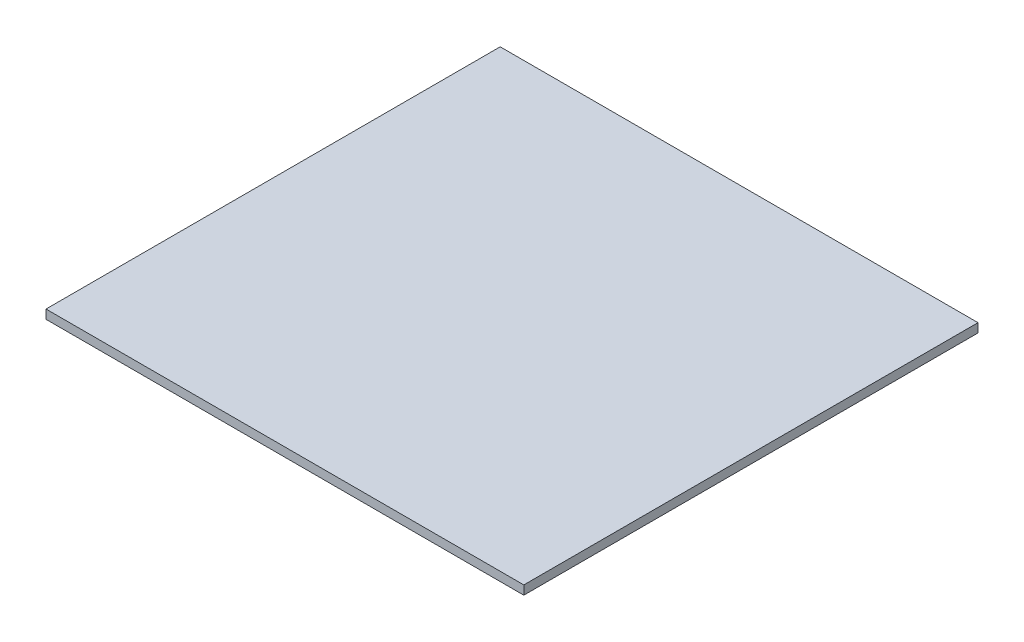
ISO-10303-21;
HEADER;
FILE_DESCRIPTION(('STEP AP214'),'2;1');
FILE_NAME('part.step','',(''),(''),'','','');
FILE_SCHEMA(('AUTOMOTIVE_DESIGN { 1 0 10303 214 1 1 1 1 }'));
ENDSEC;
DATA;
#1=APPLICATION_CONTEXT('core data for automotive mechanical design processes');
#2=APPLICATION_PROTOCOL_DEFINITION('international standard','automotive_design',2000,#1);
#3=PRODUCT_CONTEXT('',#1,'mechanical');
#4=PRODUCT('Part','Part','',(#3));
#5=PRODUCT_RELATED_PRODUCT_CATEGORY('part','',(#4));
#6=PRODUCT_DEFINITION_FORMATION('','',#4);
#7=PRODUCT_DEFINITION_CONTEXT('part definition',#1,'design');
#8=PRODUCT_DEFINITION('design','',#6,#7);
#9=PRODUCT_DEFINITION_SHAPE('','',#8);
#10=(LENGTH_UNIT() NAMED_UNIT(*) SI_UNIT(.MILLI.,.METRE.));
#11=(NAMED_UNIT(*) PLANE_ANGLE_UNIT() SI_UNIT($,.RADIAN.));
#12=(NAMED_UNIT(*) SI_UNIT($,.STERADIAN.) SOLID_ANGLE_UNIT());
#13=UNCERTAINTY_MEASURE_WITH_UNIT(LENGTH_MEASURE(1.E-05),#10,'distance_accuracy_value','');
#14=(GEOMETRIC_REPRESENTATION_CONTEXT(3) GLOBAL_UNCERTAINTY_ASSIGNED_CONTEXT((#13)) GLOBAL_UNIT_ASSIGNED_CONTEXT((#10,
#11,#12)) REPRESENTATION_CONTEXT('',''));
#15=CARTESIAN_POINT('',(0.,0.,0.));
#16=DIRECTION('',(0.,0.,1.));
#17=DIRECTION('',(1.,0.,0.));
#18=AXIS2_PLACEMENT_3D('',#15,#16,#17);
#19=CARTESIAN_POINT('',(91.,1.7,0.));
#20=DIRECTION('',(0.,0.,-1.));
#21=DIRECTION('',(-1.,0.,0.));
#22=AXIS2_PLACEMENT_3D('',#19,#20,#21);
#23=PLANE('',#22);
#24=DIRECTION('',(1.,0.,0.));
#25=VECTOR('',#24,1.);
#26=CARTESIAN_POINT('',(91.,0.,0.));
#27=LINE('',#26,#25);
#28=CARTESIAN_POINT('',(0.,0.,0.));
#29=VERTEX_POINT('',#28);
#30=CARTESIAN_POINT('',(91.,0.,0.));
#31=VERTEX_POINT('',#30);
#32=EDGE_CURVE('E99',#29,#31,#27,.T.);
#33=ORIENTED_EDGE('',*,*,#32,.T.);
#34=DIRECTION('',(0.,-1.,0.));
#35=VECTOR('',#34,1.);
#36=CARTESIAN_POINT('',(91.,1.7,0.));
#37=LINE('',#36,#35);
#38=CARTESIAN_POINT('',(91.,1.7,0.));
#39=VERTEX_POINT('',#38);
#40=EDGE_CURVE('E11',#39,#31,#37,.T.);
#41=ORIENTED_EDGE('',*,*,#40,.F.);
#42=DIRECTION('',(1.,0.,0.));
#43=VECTOR('',#42,1.);
#44=CARTESIAN_POINT('',(91.,1.7,0.));
#45=LINE('',#44,#43);
#46=CARTESIAN_POINT('',(0.,1.7,0.));
#47=VERTEX_POINT('',#46);
#48=EDGE_CURVE('E87',#47,#39,#45,.T.);
#49=ORIENTED_EDGE('',*,*,#48,.F.);
#50=DIRECTION('',(0.,-1.,0.));
#51=VECTOR('',#50,1.);
#52=CARTESIAN_POINT('',(0.,1.7,0.));
#53=LINE('',#52,#51);
#54=EDGE_CURVE('E95',#47,#29,#53,.T.);
#55=ORIENTED_EDGE('',*,*,#54,.T.);
#56=EDGE_LOOP('',(#33,#41,#49,#55));
#57=FACE_BOUND('',#56,.T.);
#58=ADVANCED_FACE('F36',(#57),#23,.F.);
#59=CARTESIAN_POINT('',(91.,1.7,-86.5));
#60=DIRECTION('',(-1.,0.,0.));
#61=DIRECTION('',(0.,0.,1.));
#62=AXIS2_PLACEMENT_3D('',#59,#60,#61);
#63=PLANE('',#62);
#64=DIRECTION('',(0.,0.,-1.));
#65=VECTOR('',#64,1.);
#66=CARTESIAN_POINT('',(91.,0.,-86.5));
#67=LINE('',#66,#65);
#68=CARTESIAN_POINT('',(91.,0.,-86.5));
#69=VERTEX_POINT('',#68);
#70=EDGE_CURVE('E91',#31,#69,#67,.T.);
#71=ORIENTED_EDGE('',*,*,#70,.T.);
#72=DIRECTION('',(0.,-1.,0.));
#73=VECTOR('',#72,1.);
#74=CARTESIAN_POINT('',(91.,1.7,-86.5));
#75=LINE('',#74,#73);
#76=CARTESIAN_POINT('',(91.,1.7,-86.5));
#77=VERTEX_POINT('',#76);
#78=EDGE_CURVE('E44',#77,#69,#75,.T.);
#79=ORIENTED_EDGE('',*,*,#78,.F.);
#80=DIRECTION('',(0.,0.,-1.));
#81=VECTOR('',#80,1.);
#82=CARTESIAN_POINT('',(91.,1.7,-86.5));
#83=LINE('',#82,#81);
#84=EDGE_CURVE('E82',#39,#77,#83,.T.);
#85=ORIENTED_EDGE('',*,*,#84,.F.);
#86=ORIENTED_EDGE('',*,*,#40,.T.);
#87=EDGE_LOOP('',(#71,#79,#85,#86));
#88=FACE_BOUND('',#87,.T.);
#89=ADVANCED_FACE('F90',(#88),#63,.F.);
#90=CARTESIAN_POINT('',(0.,1.7,-86.5));
#91=DIRECTION('',(0.,0.,1.));
#92=DIRECTION('',(1.,0.,0.));
#93=AXIS2_PLACEMENT_3D('',#90,#91,#92);
#94=PLANE('',#93);
#95=DIRECTION('',(-1.,0.,0.));
#96=VECTOR('',#95,1.);
#97=CARTESIAN_POINT('',(0.,0.,-86.5));
#98=LINE('',#97,#96);
#99=CARTESIAN_POINT('',(0.,0.,-86.5));
#100=VERTEX_POINT('',#99);
#101=EDGE_CURVE('E69',#69,#100,#98,.T.);
#102=ORIENTED_EDGE('',*,*,#101,.T.);
#103=DIRECTION('',(0.,-1.,0.));
#104=VECTOR('',#103,1.);
#105=CARTESIAN_POINT('',(0.,1.7,-86.5));
#106=LINE('',#105,#104);
#107=CARTESIAN_POINT('',(0.,1.7,-86.5));
#108=VERTEX_POINT('',#107);
#109=EDGE_CURVE('E92',#108,#100,#106,.T.);
#110=ORIENTED_EDGE('',*,*,#109,.F.);
#111=DIRECTION('',(-1.,0.,0.));
#112=VECTOR('',#111,1.);
#113=CARTESIAN_POINT('',(0.,1.7,-86.5));
#114=LINE('',#113,#112);
#115=EDGE_CURVE('E85',#77,#108,#114,.T.);
#116=ORIENTED_EDGE('',*,*,#115,.F.);
#117=ORIENTED_EDGE('',*,*,#78,.T.);
#118=EDGE_LOOP('',(#102,#110,#116,#117));
#119=FACE_BOUND('',#118,.T.);
#120=ADVANCED_FACE('F93',(#119),#94,.F.);
#121=CARTESIAN_POINT('',(0.,1.7,0.));
#122=DIRECTION('',(1.,0.,0.));
#123=DIRECTION('',(0.,0.,-1.));
#124=AXIS2_PLACEMENT_3D('',#121,#122,#123);
#125=PLANE('',#124);
#126=DIRECTION('',(0.,0.,1.));
#127=VECTOR('',#126,1.);
#128=CARTESIAN_POINT('',(0.,0.,0.));
#129=LINE('',#128,#127);
#130=EDGE_CURVE('E75',#100,#29,#129,.T.);
#131=ORIENTED_EDGE('',*,*,#130,.T.);
#132=ORIENTED_EDGE('',*,*,#54,.F.);
#133=DIRECTION('',(0.,0.,1.));
#134=VECTOR('',#133,1.);
#135=CARTESIAN_POINT('',(0.,1.7,0.));
#136=LINE('',#135,#134);
#137=EDGE_CURVE('E52',#108,#47,#136,.T.);
#138=ORIENTED_EDGE('',*,*,#137,.F.);
#139=ORIENTED_EDGE('',*,*,#109,.T.);
#140=EDGE_LOOP('',(#131,#132,#138,#139));
#141=FACE_BOUND('',#140,.T.);
#142=ADVANCED_FACE('F106',(#141),#125,.F.);
#143=CARTESIAN_POINT('',(0.,1.7,0.));
#144=DIRECTION('',(0.,-1.,0.));
#145=DIRECTION('',(0.,0.,-1.));
#146=AXIS2_PLACEMENT_3D('',#143,#144,#145);
#147=PLANE('',#146);
#148=ORIENTED_EDGE('',*,*,#48,.T.);
#149=ORIENTED_EDGE('',*,*,#84,.T.);
#150=ORIENTED_EDGE('',*,*,#115,.T.);
#151=ORIENTED_EDGE('',*,*,#137,.T.);
#152=EDGE_LOOP('',(#148,#149,#150,#151));
#153=FACE_BOUND('',#152,.T.);
#154=ADVANCED_FACE('F83',(#153),#147,.F.);
#155=CARTESIAN_POINT('',(0.,0.,0.));
#156=DIRECTION('',(0.,-1.,0.));
#157=DIRECTION('',(0.,0.,-1.));
#158=AXIS2_PLACEMENT_3D('',#155,#156,#157);
#159=PLANE('',#158);
#160=ORIENTED_EDGE('',*,*,#32,.F.);
#161=ORIENTED_EDGE('',*,*,#130,.F.);
#162=ORIENTED_EDGE('',*,*,#101,.F.);
#163=ORIENTED_EDGE('',*,*,#70,.F.);
#164=EDGE_LOOP('',(#160,#161,#162,#163));
#165=FACE_BOUND('',#164,.T.);
#166=ADVANCED_FACE('F109',(#165),#159,.T.);
#167=CLOSED_SHELL('',(#58,#89,#120,#142,#154,#166));
#168=MANIFOLD_SOLID_BREP('B2',#167);
#169=ADVANCED_BREP_SHAPE_REPRESENTATION('',(#18,#168),#14);
#170=SHAPE_DEFINITION_REPRESENTATION(#9,#169);
ENDSEC;
END-ISO-10303-21;
